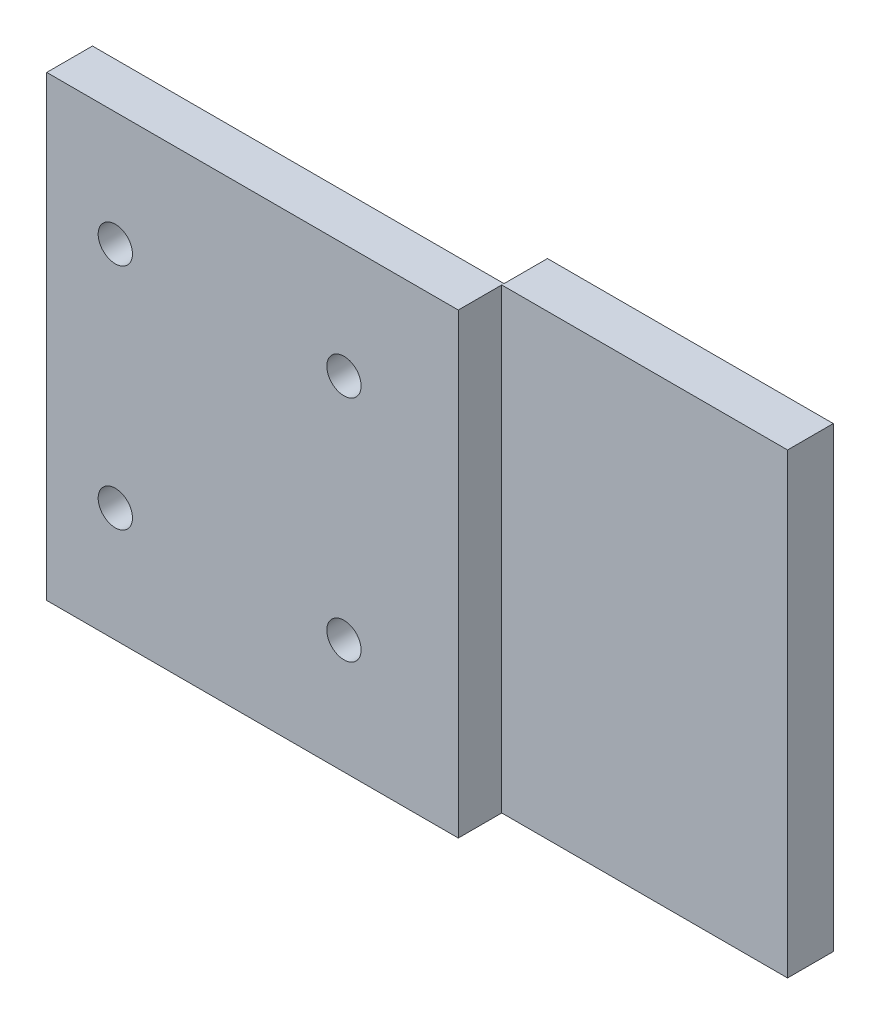
ISO-10303-21;
HEADER;
FILE_DESCRIPTION(('STEP AP214'),'2;1');
FILE_NAME('part.step','',(''),(''),'','','');
FILE_SCHEMA(('AUTOMOTIVE_DESIGN { 1 0 10303 214 1 1 1 1 }'));
ENDSEC;
DATA;
#1=APPLICATION_CONTEXT('core data for automotive mechanical design processes');
#2=APPLICATION_PROTOCOL_DEFINITION('international standard','automotive_design',2000,#1);
#3=PRODUCT_CONTEXT('',#1,'mechanical');
#4=PRODUCT('Part','Part','',(#3));
#5=PRODUCT_RELATED_PRODUCT_CATEGORY('part','',(#4));
#6=PRODUCT_DEFINITION_FORMATION('','',#4);
#7=PRODUCT_DEFINITION_CONTEXT('part definition',#1,'design');
#8=PRODUCT_DEFINITION('design','',#6,#7);
#9=PRODUCT_DEFINITION_SHAPE('','',#8);
#10=(LENGTH_UNIT() NAMED_UNIT(*) SI_UNIT(.MILLI.,.METRE.));
#11=(NAMED_UNIT(*) PLANE_ANGLE_UNIT() SI_UNIT($,.RADIAN.));
#12=(NAMED_UNIT(*) SI_UNIT($,.STERADIAN.) SOLID_ANGLE_UNIT());
#13=UNCERTAINTY_MEASURE_WITH_UNIT(LENGTH_MEASURE(1.E-05),#10,'distance_accuracy_value','');
#14=(GEOMETRIC_REPRESENTATION_CONTEXT(3) GLOBAL_UNCERTAINTY_ASSIGNED_CONTEXT((#13)) GLOBAL_UNIT_ASSIGNED_CONTEXT((#10,
#11,#12)) REPRESENTATION_CONTEXT('',''));
#15=CARTESIAN_POINT('',(0.,0.,0.));
#16=DIRECTION('',(0.,0.,1.));
#17=DIRECTION('',(1.,0.,0.));
#18=AXIS2_PLACEMENT_3D('',#15,#16,#17);
#19=CARTESIAN_POINT('',(36.,0.,4.));
#20=DIRECTION('',(-1.,0.,0.));
#21=DIRECTION('',(0.,-1.,0.));
#22=AXIS2_PLACEMENT_3D('',#19,#20,#21);
#23=PLANE('',#22);
#24=DIRECTION('',(0.,-1.,0.));
#25=VECTOR('',#24,1.);
#26=CARTESIAN_POINT('',(36.,0.,0.2));
#27=LINE('',#26,#25);
#28=CARTESIAN_POINT('',(36.,40.,0.2));
#29=VERTEX_POINT('',#28);
#30=CARTESIAN_POINT('',(36.,0.,0.2));
#31=VERTEX_POINT('',#30);
#32=EDGE_CURVE('E51',#29,#31,#27,.T.);
#33=ORIENTED_EDGE('',*,*,#32,.F.);
#34=DIRECTION('',(0.,0.,-1.));
#35=VECTOR('',#34,1.);
#36=CARTESIAN_POINT('',(36.,40.,4.));
#37=LINE('',#36,#35);
#38=CARTESIAN_POINT('',(36.,40.,4.));
#39=VERTEX_POINT('',#38);
#40=EDGE_CURVE('E180',#39,#29,#37,.T.);
#41=ORIENTED_EDGE('',*,*,#40,.F.);
#42=DIRECTION('',(0.,1.,0.));
#43=VECTOR('',#42,1.);
#44=CARTESIAN_POINT('',(36.,0.,4.));
#45=LINE('',#44,#43);
#46=CARTESIAN_POINT('',(36.,0.,4.));
#47=VERTEX_POINT('',#46);
#48=EDGE_CURVE('E185',#47,#39,#45,.T.);
#49=ORIENTED_EDGE('',*,*,#48,.F.);
#50=DIRECTION('',(0.,0.,-1.));
#51=VECTOR('',#50,1.);
#52=CARTESIAN_POINT('',(36.,0.,4.));
#53=LINE('',#52,#51);
#54=EDGE_CURVE('E43',#47,#31,#53,.T.);
#55=ORIENTED_EDGE('',*,*,#54,.T.);
#56=EDGE_LOOP('',(#33,#41,#49,#55));
#57=FACE_BOUND('',#56,.T.);
#58=ADVANCED_FACE('F34',(#57),#23,.F.);
#59=CARTESIAN_POINT('',(0.,0.,4.));
#60=DIRECTION('',(0.,0.,-1.));
#61=DIRECTION('',(-1.,0.,0.));
#62=AXIS2_PLACEMENT_3D('',#59,#60,#61);
#63=PLANE('',#62);
#64=DIRECTION('',(0.,-1.,0.));
#65=VECTOR('',#64,1.);
#66=CARTESIAN_POINT('',(0.,0.,4.));
#67=LINE('',#66,#65);
#68=CARTESIAN_POINT('',(0.,40.,4.));
#69=VERTEX_POINT('',#68);
#70=CARTESIAN_POINT('',(0.,0.,4.));
#71=VERTEX_POINT('',#70);
#72=EDGE_CURVE('E198',#69,#71,#67,.T.);
#73=ORIENTED_EDGE('',*,*,#72,.T.);
#74=DIRECTION('',(1.,0.,0.));
#75=VECTOR('',#74,1.);
#76=CARTESIAN_POINT('',(0.,0.,4.));
#77=LINE('',#76,#75);
#78=EDGE_CURVE('E87',#71,#47,#77,.T.);
#79=ORIENTED_EDGE('',*,*,#78,.T.);
#80=ORIENTED_EDGE('',*,*,#48,.T.);
#81=DIRECTION('',(-1.,0.,0.));
#82=VECTOR('',#81,1.);
#83=CARTESIAN_POINT('',(0.,40.,4.));
#84=LINE('',#83,#82);
#85=EDGE_CURVE('E60',#39,#69,#84,.T.);
#86=ORIENTED_EDGE('',*,*,#85,.T.);
#87=EDGE_LOOP('',(#73,#79,#80,#86));
#88=FACE_BOUND('',#87,.T.);
#89=CARTESIAN_POINT('',(5.99999999999999,30.,4.));
#90=DIRECTION('',(0.,0.,1.));
#91=DIRECTION('',(1.,0.,0.));
#92=AXIS2_PLACEMENT_3D('',#89,#90,#91);
#93=CIRCLE('',#92,1.5);
#94=CARTESIAN_POINT('',(7.49999999999999,30.,4.));
#95=VERTEX_POINT('',#94);
#96=EDGE_CURVE('E210',#95,#95,#93,.T.);
#97=ORIENTED_EDGE('',*,*,#96,.F.);
#98=EDGE_LOOP('',(#97));
#99=FACE_BOUND('',#98,.T.);
#100=CARTESIAN_POINT('',(26.,30.,4.));
#101=DIRECTION('',(0.,0.,1.));
#102=DIRECTION('',(1.,0.,0.));
#103=AXIS2_PLACEMENT_3D('',#100,#101,#102);
#104=CIRCLE('',#103,1.5);
#105=CARTESIAN_POINT('',(27.5,30.,4.));
#106=VERTEX_POINT('',#105);
#107=EDGE_CURVE('E216',#106,#106,#104,.T.);
#108=ORIENTED_EDGE('',*,*,#107,.F.);
#109=EDGE_LOOP('',(#108));
#110=FACE_BOUND('',#109,.T.);
#111=CARTESIAN_POINT('',(26.,10.,4.));
#112=DIRECTION('',(0.,0.,1.));
#113=DIRECTION('',(1.,0.,0.));
#114=AXIS2_PLACEMENT_3D('',#111,#112,#113);
#115=CIRCLE('',#114,1.5);
#116=CARTESIAN_POINT('',(27.5,10.,4.));
#117=VERTEX_POINT('',#116);
#118=EDGE_CURVE('E221',#117,#117,#115,.T.);
#119=ORIENTED_EDGE('',*,*,#118,.F.);
#120=EDGE_LOOP('',(#119));
#121=FACE_BOUND('',#120,.T.);
#122=CARTESIAN_POINT('',(5.99999999999999,10.,4.));
#123=DIRECTION('',(0.,0.,1.));
#124=DIRECTION('',(1.,0.,0.));
#125=AXIS2_PLACEMENT_3D('',#122,#123,#124);
#126=CIRCLE('',#125,1.5);
#127=CARTESIAN_POINT('',(7.49999999999999,10.,4.));
#128=VERTEX_POINT('',#127);
#129=EDGE_CURVE('E136',#128,#128,#126,.T.);
#130=ORIENTED_EDGE('',*,*,#129,.F.);
#131=EDGE_LOOP('',(#130));
#132=FACE_BOUND('',#131,.T.);
#133=ADVANCED_FACE('F207',(#88,#99,#110,#121,#132),#63,.F.);
#134=CARTESIAN_POINT('',(0.,0.,0.));
#135=DIRECTION('',(0.,0.,-1.));
#136=DIRECTION('',(-1.,0.,0.));
#137=AXIS2_PLACEMENT_3D('',#134,#135,#136);
#138=PLANE('',#137);
#139=CARTESIAN_POINT('',(26.,10.,0.));
#140=DIRECTION('',(0.,0.,1.));
#141=DIRECTION('',(1.,0.,0.));
#142=AXIS2_PLACEMENT_3D('',#139,#140,#141);
#143=CIRCLE('',#142,1.5);
#144=CARTESIAN_POINT('',(27.5,10.,0.));
#145=VERTEX_POINT('',#144);
#146=EDGE_CURVE('E224',#145,#145,#143,.T.);
#147=ORIENTED_EDGE('',*,*,#146,.T.);
#148=EDGE_LOOP('',(#147));
#149=FACE_BOUND('',#148,.T.);
#150=CARTESIAN_POINT('',(5.99999999999999,30.,0.));
#151=DIRECTION('',(0.,0.,1.));
#152=DIRECTION('',(1.,0.,0.));
#153=AXIS2_PLACEMENT_3D('',#150,#151,#152);
#154=CIRCLE('',#153,1.5);
#155=CARTESIAN_POINT('',(7.49999999999999,30.,0.));
#156=VERTEX_POINT('',#155);
#157=EDGE_CURVE('E204',#156,#156,#154,.T.);
#158=ORIENTED_EDGE('',*,*,#157,.T.);
#159=EDGE_LOOP('',(#158));
#160=FACE_BOUND('',#159,.T.);
#161=DIRECTION('',(0.,-1.,0.));
#162=VECTOR('',#161,1.);
#163=CARTESIAN_POINT('',(0.,0.,0.));
#164=LINE('',#163,#162);
#165=CARTESIAN_POINT('',(0.,40.,0.));
#166=VERTEX_POINT('',#165);
#167=CARTESIAN_POINT('',(0.,0.,0.));
#168=VERTEX_POINT('',#167);
#169=EDGE_CURVE('E176',#166,#168,#164,.T.);
#170=ORIENTED_EDGE('',*,*,#169,.F.);
#171=DIRECTION('',(-1.,0.,0.));
#172=VECTOR('',#171,1.);
#173=CARTESIAN_POINT('',(0.,40.,0.));
#174=LINE('',#173,#172);
#175=CARTESIAN_POINT('',(36.,40.,0.));
#176=VERTEX_POINT('',#175);
#177=EDGE_CURVE('E80',#176,#166,#174,.T.);
#178=ORIENTED_EDGE('',*,*,#177,.F.);
#179=DIRECTION('',(0.,1.,0.));
#180=VECTOR('',#179,1.);
#181=CARTESIAN_POINT('',(36.,0.,0.));
#182=LINE('',#181,#180);
#183=CARTESIAN_POINT('',(36.,0.,0.));
#184=VERTEX_POINT('',#183);
#185=EDGE_CURVE('E167',#184,#176,#182,.T.);
#186=ORIENTED_EDGE('',*,*,#185,.F.);
#187=DIRECTION('',(1.,0.,0.));
#188=VECTOR('',#187,1.);
#189=CARTESIAN_POINT('',(0.,0.,0.));
#190=LINE('',#189,#188);
#191=EDGE_CURVE('E171',#168,#184,#190,.T.);
#192=ORIENTED_EDGE('',*,*,#191,.F.);
#193=EDGE_LOOP('',(#170,#178,#186,#192));
#194=FACE_BOUND('',#193,.T.);
#195=CARTESIAN_POINT('',(26.,30.,0.));
#196=DIRECTION('',(0.,0.,1.));
#197=DIRECTION('',(1.,0.,0.));
#198=AXIS2_PLACEMENT_3D('',#195,#196,#197);
#199=CIRCLE('',#198,1.5);
#200=CARTESIAN_POINT('',(27.5,30.,0.));
#201=VERTEX_POINT('',#200);
#202=EDGE_CURVE('E218',#201,#201,#199,.T.);
#203=ORIENTED_EDGE('',*,*,#202,.T.);
#204=EDGE_LOOP('',(#203));
#205=FACE_BOUND('',#204,.T.);
#206=CARTESIAN_POINT('',(5.99999999999999,10.,0.));
#207=DIRECTION('',(0.,0.,1.));
#208=DIRECTION('',(1.,0.,0.));
#209=AXIS2_PLACEMENT_3D('',#206,#207,#208);
#210=CIRCLE('',#209,1.5);
#211=CARTESIAN_POINT('',(7.49999999999999,10.,0.));
#212=VERTEX_POINT('',#211);
#213=EDGE_CURVE('E133',#212,#212,#210,.T.);
#214=ORIENTED_EDGE('',*,*,#213,.T.);
#215=EDGE_LOOP('',(#214));
#216=FACE_BOUND('',#215,.T.);
#217=ADVANCED_FACE('F195',(#149,#160,#194,#205,#216),#138,.T.);
#218=CARTESIAN_POINT('',(0.,0.,4.));
#219=DIRECTION('',(1.,0.,0.));
#220=DIRECTION('',(0.,1.,0.));
#221=AXIS2_PLACEMENT_3D('',#218,#219,#220);
#222=PLANE('',#221);
#223=ORIENTED_EDGE('',*,*,#169,.T.);
#224=DIRECTION('',(0.,0.,-1.));
#225=VECTOR('',#224,1.);
#226=CARTESIAN_POINT('',(0.,0.,4.));
#227=LINE('',#226,#225);
#228=EDGE_CURVE('E11',#71,#168,#227,.T.);
#229=ORIENTED_EDGE('',*,*,#228,.F.);
#230=ORIENTED_EDGE('',*,*,#72,.F.);
#231=DIRECTION('',(0.,0.,-1.));
#232=VECTOR('',#231,1.);
#233=CARTESIAN_POINT('',(0.,40.,4.));
#234=LINE('',#233,#232);
#235=EDGE_CURVE('E178',#69,#166,#234,.T.);
#236=ORIENTED_EDGE('',*,*,#235,.T.);
#237=EDGE_LOOP('',(#223,#229,#230,#236));
#238=FACE_BOUND('',#237,.T.);
#239=ADVANCED_FACE('F36',(#238),#222,.F.);
#240=CARTESIAN_POINT('',(0.,0.,4.));
#241=DIRECTION('',(0.,1.,0.));
#242=DIRECTION('',(-1.,0.,0.));
#243=AXIS2_PLACEMENT_3D('',#240,#241,#242);
#244=PLANE('',#243);
#245=ORIENTED_EDGE('',*,*,#191,.T.);
#246=DIRECTION('',(0.,0.,-1.));
#247=VECTOR('',#246,1.);
#248=CARTESIAN_POINT('',(36.,0.,0.2));
#249=LINE('',#248,#247);
#250=CARTESIAN_POINT('',(36.,0.,-3.8));
#251=VERTEX_POINT('',#250);
#252=EDGE_CURVE('E131',#184,#251,#249,.T.);
#253=ORIENTED_EDGE('',*,*,#252,.T.);
#254=DIRECTION('',(-1.,0.,0.));
#255=VECTOR('',#254,1.);
#256=CARTESIAN_POINT('',(61.,0.,-3.8));
#257=LINE('',#256,#255);
#258=CARTESIAN_POINT('',(61.,0.,-3.8));
#259=VERTEX_POINT('',#258);
#260=EDGE_CURVE('E114',#259,#251,#257,.T.);
#261=ORIENTED_EDGE('',*,*,#260,.F.);
#262=DIRECTION('',(0.,0.,-1.));
#263=VECTOR('',#262,1.);
#264=CARTESIAN_POINT('',(61.,0.,0.2));
#265=LINE('',#264,#263);
#266=CARTESIAN_POINT('',(61.,0.,0.2));
#267=VERTEX_POINT('',#266);
#268=EDGE_CURVE('E120',#267,#259,#265,.T.);
#269=ORIENTED_EDGE('',*,*,#268,.F.);
#270=DIRECTION('',(-1.,0.,0.));
#271=VECTOR('',#270,1.);
#272=CARTESIAN_POINT('',(61.,0.,0.2));
#273=LINE('',#272,#271);
#274=EDGE_CURVE('E159',#267,#31,#273,.T.);
#275=ORIENTED_EDGE('',*,*,#274,.T.);
#276=ORIENTED_EDGE('',*,*,#54,.F.);
#277=ORIENTED_EDGE('',*,*,#78,.F.);
#278=ORIENTED_EDGE('',*,*,#228,.T.);
#279=EDGE_LOOP('',(#245,#253,#261,#269,#275,#276,#277,#278));
#280=FACE_BOUND('',#279,.T.);
#281=ADVANCED_FACE('F129',(#280),#244,.F.);
#282=CARTESIAN_POINT('',(0.,40.,4.));
#283=DIRECTION('',(0.,-1.,0.));
#284=DIRECTION('',(1.,0.,0.));
#285=AXIS2_PLACEMENT_3D('',#282,#283,#284);
#286=PLANE('',#285);
#287=ORIENTED_EDGE('',*,*,#177,.T.);
#288=ORIENTED_EDGE('',*,*,#235,.F.);
#289=ORIENTED_EDGE('',*,*,#85,.F.);
#290=ORIENTED_EDGE('',*,*,#40,.T.);
#291=DIRECTION('',(-1.,0.,0.));
#292=VECTOR('',#291,1.);
#293=CARTESIAN_POINT('',(61.,40.,0.2));
#294=LINE('',#293,#292);
#295=CARTESIAN_POINT('',(61.,40.,0.2));
#296=VERTEX_POINT('',#295);
#297=EDGE_CURVE('E138',#296,#29,#294,.T.);
#298=ORIENTED_EDGE('',*,*,#297,.F.);
#299=DIRECTION('',(0.,0.,1.));
#300=VECTOR('',#299,1.);
#301=CARTESIAN_POINT('',(61.,40.,0.2));
#302=LINE('',#301,#300);
#303=CARTESIAN_POINT('',(61.,40.,-3.8));
#304=VERTEX_POINT('',#303);
#305=EDGE_CURVE('E119',#304,#296,#302,.T.);
#306=ORIENTED_EDGE('',*,*,#305,.F.);
#307=DIRECTION('',(-1.,0.,0.));
#308=VECTOR('',#307,1.);
#309=CARTESIAN_POINT('',(61.,40.,-3.8));
#310=LINE('',#309,#308);
#311=CARTESIAN_POINT('',(36.,40.,-3.8));
#312=VERTEX_POINT('',#311);
#313=EDGE_CURVE('E116',#304,#312,#310,.T.);
#314=ORIENTED_EDGE('',*,*,#313,.T.);
#315=DIRECTION('',(0.,0.,1.));
#316=VECTOR('',#315,1.);
#317=CARTESIAN_POINT('',(36.,40.,0.2));
#318=LINE('',#317,#316);
#319=EDGE_CURVE('E145',#312,#176,#318,.T.);
#320=ORIENTED_EDGE('',*,*,#319,.T.);
#321=EDGE_LOOP('',(#287,#288,#289,#290,#298,#306,#314,#320));
#322=FACE_BOUND('',#321,.T.);
#323=ADVANCED_FACE('F188',(#322),#286,.F.);
#324=CARTESIAN_POINT('',(5.99999999999999,30.,4.));
#325=DIRECTION('',(0.,0.,-1.));
#326=DIRECTION('',(-1.,0.,0.));
#327=AXIS2_PLACEMENT_3D('',#324,#325,#326);
#328=CYLINDRICAL_SURFACE('',#327,1.5);
#329=ORIENTED_EDGE('',*,*,#96,.T.);
#330=EDGE_LOOP('',(#329));
#331=FACE_BOUND('',#330,.T.);
#332=ORIENTED_EDGE('',*,*,#157,.F.);
#333=EDGE_LOOP('',(#332));
#334=FACE_BOUND('',#333,.T.);
#335=ADVANCED_FACE('F244',(#331,#334),#328,.F.);
#336=CARTESIAN_POINT('',(26.,30.,4.));
#337=DIRECTION('',(0.,0.,-1.));
#338=DIRECTION('',(-1.,0.,0.));
#339=AXIS2_PLACEMENT_3D('',#336,#337,#338);
#340=CYLINDRICAL_SURFACE('',#339,1.5);
#341=ORIENTED_EDGE('',*,*,#107,.T.);
#342=EDGE_LOOP('',(#341));
#343=FACE_BOUND('',#342,.T.);
#344=ORIENTED_EDGE('',*,*,#202,.F.);
#345=EDGE_LOOP('',(#344));
#346=FACE_BOUND('',#345,.T.);
#347=ADVANCED_FACE('F318',(#343,#346),#340,.F.);
#348=CARTESIAN_POINT('',(26.,10.,4.));
#349=DIRECTION('',(0.,0.,-1.));
#350=DIRECTION('',(-1.,0.,0.));
#351=AXIS2_PLACEMENT_3D('',#348,#349,#350);
#352=CYLINDRICAL_SURFACE('',#351,1.5);
#353=ORIENTED_EDGE('',*,*,#118,.T.);
#354=EDGE_LOOP('',(#353));
#355=FACE_BOUND('',#354,.T.);
#356=ORIENTED_EDGE('',*,*,#146,.F.);
#357=EDGE_LOOP('',(#356));
#358=FACE_BOUND('',#357,.T.);
#359=ADVANCED_FACE('F316',(#355,#358),#352,.F.);
#360=CARTESIAN_POINT('',(5.99999999999999,10.,4.));
#361=DIRECTION('',(0.,0.,-1.));
#362=DIRECTION('',(-1.,0.,0.));
#363=AXIS2_PLACEMENT_3D('',#360,#361,#362);
#364=CYLINDRICAL_SURFACE('',#363,1.5);
#365=ORIENTED_EDGE('',*,*,#129,.T.);
#366=EDGE_LOOP('',(#365));
#367=FACE_BOUND('',#366,.T.);
#368=ORIENTED_EDGE('',*,*,#213,.F.);
#369=EDGE_LOOP('',(#368));
#370=FACE_BOUND('',#369,.T.);
#371=ADVANCED_FACE('F231',(#367,#370),#364,.F.);
#372=CARTESIAN_POINT('',(36.,0.,0.));
#373=DIRECTION('',(1.,0.,0.));
#374=DIRECTION('',(0.,1.,0.));
#375=AXIS2_PLACEMENT_3D('',#372,#373,#374);
#376=PLANE('',#375);
#377=ORIENTED_EDGE('',*,*,#252,.F.);
#378=ORIENTED_EDGE('',*,*,#185,.T.);
#379=ORIENTED_EDGE('',*,*,#319,.F.);
#380=DIRECTION('',(0.,1.,0.));
#381=VECTOR('',#380,1.);
#382=CARTESIAN_POINT('',(36.,0.,-3.8));
#383=LINE('',#382,#381);
#384=EDGE_CURVE('E144',#251,#312,#383,.T.);
#385=ORIENTED_EDGE('',*,*,#384,.F.);
#386=EDGE_LOOP('',(#377,#378,#379,#385));
#387=FACE_BOUND('',#386,.T.);
#388=ADVANCED_FACE('F191',(#387),#376,.F.);
#389=CARTESIAN_POINT('',(61.,0.,-3.8));
#390=DIRECTION('',(0.,0.,1.));
#391=DIRECTION('',(1.,0.,0.));
#392=AXIS2_PLACEMENT_3D('',#389,#390,#391);
#393=PLANE('',#392);
#394=ORIENTED_EDGE('',*,*,#384,.T.);
#395=ORIENTED_EDGE('',*,*,#313,.F.);
#396=DIRECTION('',(0.,1.,0.));
#397=VECTOR('',#396,1.);
#398=CARTESIAN_POINT('',(61.,0.,-3.8));
#399=LINE('',#398,#397);
#400=EDGE_CURVE('E110',#259,#304,#399,.T.);
#401=ORIENTED_EDGE('',*,*,#400,.F.);
#402=ORIENTED_EDGE('',*,*,#260,.T.);
#403=EDGE_LOOP('',(#394,#395,#401,#402));
#404=FACE_BOUND('',#403,.T.);
#405=ADVANCED_FACE('F112',(#404),#393,.F.);
#406=CARTESIAN_POINT('',(61.,0.,0.2));
#407=DIRECTION('',(0.,0.,-1.));
#408=DIRECTION('',(-1.,0.,0.));
#409=AXIS2_PLACEMENT_3D('',#406,#407,#408);
#410=PLANE('',#409);
#411=ORIENTED_EDGE('',*,*,#32,.T.);
#412=ORIENTED_EDGE('',*,*,#274,.F.);
#413=DIRECTION('',(0.,-1.,0.));
#414=VECTOR('',#413,1.);
#415=CARTESIAN_POINT('',(61.,0.,0.2));
#416=LINE('',#415,#414);
#417=EDGE_CURVE('E125',#296,#267,#416,.T.);
#418=ORIENTED_EDGE('',*,*,#417,.F.);
#419=ORIENTED_EDGE('',*,*,#297,.T.);
#420=EDGE_LOOP('',(#411,#412,#418,#419));
#421=FACE_BOUND('',#420,.T.);
#422=ADVANCED_FACE('F187',(#421),#410,.F.);
#423=CARTESIAN_POINT('',(61.,0.,0.));
#424=DIRECTION('',(1.,0.,0.));
#425=DIRECTION('',(0.,1.,0.));
#426=AXIS2_PLACEMENT_3D('',#423,#424,#425);
#427=PLANE('',#426);
#428=ORIENTED_EDGE('',*,*,#268,.T.);
#429=ORIENTED_EDGE('',*,*,#400,.T.);
#430=ORIENTED_EDGE('',*,*,#305,.T.);
#431=ORIENTED_EDGE('',*,*,#417,.T.);
#432=EDGE_LOOP('',(#428,#429,#430,#431));
#433=FACE_BOUND('',#432,.T.);
#434=ADVANCED_FACE('F123',(#433),#427,.T.);
#435=CLOSED_SHELL('',(#58,#133,#217,#239,#281,#323,#335,#347,#359,#371,#388,#405,#422,#434));
#436=MANIFOLD_SOLID_BREP('B2',#435);
#437=ADVANCED_BREP_SHAPE_REPRESENTATION('',(#18,#436),#14);
#438=SHAPE_DEFINITION_REPRESENTATION(#9,#437);
ENDSEC;
END-ISO-10303-21;
